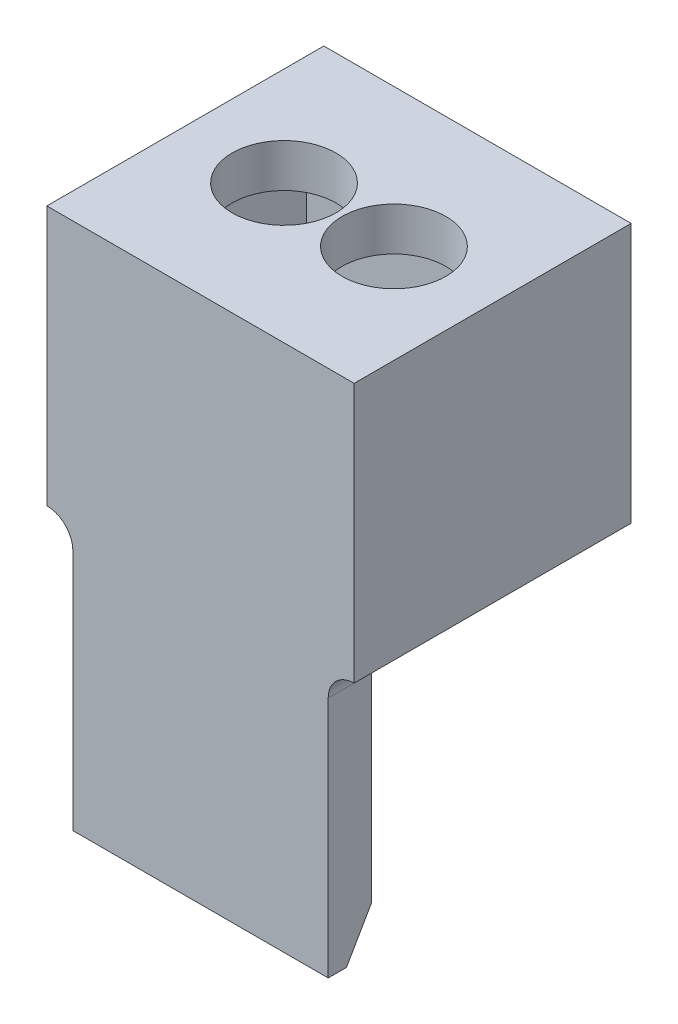
ISO-10303-21;
HEADER;
FILE_DESCRIPTION(('STEP AP214'),'2;1');
FILE_NAME('part.step','',(''),(''),'','','');
FILE_SCHEMA(('AUTOMOTIVE_DESIGN { 1 0 10303 214 1 1 1 1 }'));
ENDSEC;
DATA;
#1=APPLICATION_CONTEXT('core data for automotive mechanical design processes');
#2=APPLICATION_PROTOCOL_DEFINITION('international standard','automotive_design',2000,#1);
#3=PRODUCT_CONTEXT('',#1,'mechanical');
#4=PRODUCT('Part','Part','',(#3));
#5=PRODUCT_RELATED_PRODUCT_CATEGORY('part','',(#4));
#6=PRODUCT_DEFINITION_FORMATION('','',#4);
#7=PRODUCT_DEFINITION_CONTEXT('part definition',#1,'design');
#8=PRODUCT_DEFINITION('design','',#6,#7);
#9=PRODUCT_DEFINITION_SHAPE('','',#8);
#10=(LENGTH_UNIT() NAMED_UNIT(*) SI_UNIT(.MILLI.,.METRE.));
#11=(NAMED_UNIT(*) PLANE_ANGLE_UNIT() SI_UNIT($,.RADIAN.));
#12=(NAMED_UNIT(*) SI_UNIT($,.STERADIAN.) SOLID_ANGLE_UNIT());
#13=UNCERTAINTY_MEASURE_WITH_UNIT(LENGTH_MEASURE(1.E-05),#10,'distance_accuracy_value','');
#14=(GEOMETRIC_REPRESENTATION_CONTEXT(3) GLOBAL_UNCERTAINTY_ASSIGNED_CONTEXT((#13)) GLOBAL_UNIT_ASSIGNED_CONTEXT((#10,
#11,#12)) REPRESENTATION_CONTEXT('',''));
#15=CARTESIAN_POINT('',(0.,0.,0.));
#16=DIRECTION('',(0.,0.,1.));
#17=DIRECTION('',(1.,0.,0.));
#18=AXIS2_PLACEMENT_3D('',#15,#16,#17);
#19=CARTESIAN_POINT('',(11.3752118033071,0.,0.));
#20=DIRECTION('',(1.,0.,0.));
#21=DIRECTION('',(0.,0.,-1.));
#22=AXIS2_PLACEMENT_3D('',#19,#20,#21);
#23=PLANE('',#22);
#24=DIRECTION('',(0.,1.,0.));
#25=VECTOR('',#24,1.);
#26=CARTESIAN_POINT('',(11.3752118033071,13.0223465383006,0.659564597033571));
#27=LINE('',#26,#25);
#28=CARTESIAN_POINT('',(11.3752118033071,13.0223465383006,0.659564597033571));
#29=VERTEX_POINT('',#28);
#30=CARTESIAN_POINT('',(11.3752118033071,15.5223465383006,0.659564597033571));
#31=VERTEX_POINT('',#30);
#32=EDGE_CURVE('E151',#29,#31,#27,.T.);
#33=ORIENTED_EDGE('',*,*,#32,.F.);
#34=DIRECTION('',(0.,0.,-1.));
#35=VECTOR('',#34,1.);
#36=CARTESIAN_POINT('',(11.3752118033071,13.0223465383006,3.35956459703362));
#37=LINE('',#36,#35);
#38=CARTESIAN_POINT('',(11.3752118033071,13.0223465383006,2.85956459703362));
#39=VERTEX_POINT('',#38);
#40=EDGE_CURVE('E202',#39,#29,#37,.T.);
#41=ORIENTED_EDGE('',*,*,#40,.F.);
#42=DIRECTION('',(0.,1.,0.));
#43=VECTOR('',#42,1.);
#44=CARTESIAN_POINT('',(11.3752118033071,9.92234653830065,2.85956459703362));
#45=LINE('',#44,#43);
#46=CARTESIAN_POINT('',(11.3752118033071,15.5223465383006,2.85956459703362));
#47=VERTEX_POINT('',#46);
#48=EDGE_CURVE('E231',#39,#47,#45,.T.);
#49=ORIENTED_EDGE('',*,*,#48,.T.);
#50=DIRECTION('',(0.,0.,1.));
#51=VECTOR('',#50,1.);
#52=CARTESIAN_POINT('',(11.3752118033071,15.5223465383006,3.35956459703362));
#53=LINE('',#52,#51);
#54=EDGE_CURVE('E207',#31,#47,#53,.T.);
#55=ORIENTED_EDGE('',*,*,#54,.F.);
#56=EDGE_LOOP('',(#33,#41,#49,#55));
#57=FACE_BOUND('',#56,.T.);
#58=ADVANCED_FACE('F39',(#57),#23,.F.);
#59=CARTESIAN_POINT('',(11.3752118033071,9.92234653830065,3.35956459703362));
#60=DIRECTION('',(-1.,0.,0.));
#61=DIRECTION('',(0.,0.,1.));
#62=AXIS2_PLACEMENT_3D('',#59,#60,#61);
#63=PLANE('',#62);
#64=CARTESIAN_POINT('',(11.3752118033071,10.4223465383006,2.85956459703362));
#65=VERTEX_POINT('',#64);
#66=CARTESIAN_POINT('',(11.3752118033071,12.7223465383006,2.85956459703362));
#67=VERTEX_POINT('',#66);
#68=EDGE_CURVE('E232',#65,#67,#45,.T.);
#69=ORIENTED_EDGE('',*,*,#68,.T.);
#70=DIRECTION('',(0.,0.,-1.));
#71=VECTOR('',#70,1.);
#72=CARTESIAN_POINT('',(11.3752118033071,12.7223465383006,3.35956459703362));
#73=LINE('',#72,#71);
#74=CARTESIAN_POINT('',(11.3752118033071,12.7223465383006,3.35956459703362));
#75=VERTEX_POINT('',#74);
#76=EDGE_CURVE('E254',#67,#75,#73,.F.);
#77=ORIENTED_EDGE('',*,*,#76,.T.);
#78=DIRECTION('',(0.,1.,0.));
#79=VECTOR('',#78,1.);
#80=CARTESIAN_POINT('',(11.3752118033071,9.92234653830065,3.35956459703362));
#81=LINE('',#80,#79);
#82=CARTESIAN_POINT('',(11.3752118033071,9.92234653830065,3.35956459703362));
#83=VERTEX_POINT('',#82);
#84=EDGE_CURVE('E224',#83,#75,#81,.T.);
#85=ORIENTED_EDGE('',*,*,#84,.F.);
#86=DIRECTION('',(0.,0.,-1.));
#87=VECTOR('',#86,1.);
#88=CARTESIAN_POINT('',(11.3752118033071,9.92234653830065,3.35956459703362));
#89=LINE('',#88,#87);
#90=CARTESIAN_POINT('',(11.3752118033071,9.92234653830065,3.14823973162844));
#91=VERTEX_POINT('',#90);
#92=EDGE_CURVE('E227',#83,#91,#89,.T.);
#93=ORIENTED_EDGE('',*,*,#92,.T.);
#94=DIRECTION('',(0.,0.86602540378444,-0.499999999999999));
#95=VECTOR('',#94,1.);
#96=CARTESIAN_POINT('',(11.3752118033071,9.92234653830065,3.14823973162844));
#97=LINE('',#96,#95);
#98=EDGE_CURVE('E244',#91,#65,#97,.T.);
#99=ORIENTED_EDGE('',*,*,#98,.T.);
#100=EDGE_LOOP('',(#69,#77,#85,#93,#99));
#101=FACE_BOUND('',#100,.T.);
#102=ADVANCED_FACE('F281',(#101),#63,.F.);
#103=CARTESIAN_POINT('',(8.42521180330711,9.92234653830065,3.35956459703362));
#104=DIRECTION('',(1.,0.,0.));
#105=DIRECTION('',(0.,0.,-1.));
#106=AXIS2_PLACEMENT_3D('',#103,#104,#105);
#107=PLANE('',#106);
#108=DIRECTION('',(0.,-1.,0.));
#109=VECTOR('',#108,1.);
#110=CARTESIAN_POINT('',(8.42521180330711,9.92234653830065,3.35956459703362));
#111=LINE('',#110,#109);
#112=CARTESIAN_POINT('',(8.42521180330711,12.7223465383006,3.35956459703362));
#113=VERTEX_POINT('',#112);
#114=CARTESIAN_POINT('',(8.42521180330711,9.92234653830065,3.35956459703362));
#115=VERTEX_POINT('',#114);
#116=EDGE_CURVE('E219',#113,#115,#111,.T.);
#117=ORIENTED_EDGE('',*,*,#116,.F.);
#118=DIRECTION('',(0.,0.,-1.));
#119=VECTOR('',#118,1.);
#120=CARTESIAN_POINT('',(8.42521180330711,12.7223465383006,2.85956459703362));
#121=LINE('',#120,#119);
#122=CARTESIAN_POINT('',(8.42521180330711,12.7223465383006,2.85956459703362));
#123=VERTEX_POINT('',#122);
#124=EDGE_CURVE('E256',#113,#123,#121,.T.);
#125=ORIENTED_EDGE('',*,*,#124,.T.);
#126=DIRECTION('',(0.,-1.,0.));
#127=VECTOR('',#126,1.);
#128=CARTESIAN_POINT('',(8.42521180330711,9.92234653830065,2.85956459703362));
#129=LINE('',#128,#127);
#130=CARTESIAN_POINT('',(8.42521180330711,10.4223465383006,2.85956459703362));
#131=VERTEX_POINT('',#130);
#132=EDGE_CURVE('E218',#123,#131,#129,.T.);
#133=ORIENTED_EDGE('',*,*,#132,.T.);
#134=DIRECTION('',(0.,-0.86602540378444,0.499999999999999));
#135=VECTOR('',#134,1.);
#136=CARTESIAN_POINT('',(8.42521180330711,9.92234653830065,3.14823973162844));
#137=LINE('',#136,#135);
#138=CARTESIAN_POINT('',(8.42521180330711,9.92234653830065,3.14823973162844));
#139=VERTEX_POINT('',#138);
#140=EDGE_CURVE('E249',#131,#139,#137,.T.);
#141=ORIENTED_EDGE('',*,*,#140,.T.);
#142=DIRECTION('',(0.,0.,-1.));
#143=VECTOR('',#142,1.);
#144=CARTESIAN_POINT('',(8.42521180330711,9.92234653830065,3.35956459703362));
#145=LINE('',#144,#143);
#146=EDGE_CURVE('E238',#115,#139,#145,.T.);
#147=ORIENTED_EDGE('',*,*,#146,.F.);
#148=EDGE_LOOP('',(#117,#125,#133,#141,#147));
#149=FACE_BOUND('',#148,.T.);
#150=ADVANCED_FACE('F271',(#149),#107,.F.);
#151=CARTESIAN_POINT('',(8.42521180330711,9.92234653830065,3.35956459703362));
#152=DIRECTION('',(0.,1.,0.));
#153=DIRECTION('',(0.,0.,1.));
#154=AXIS2_PLACEMENT_3D('',#151,#152,#153);
#155=PLANE('',#154);
#156=ORIENTED_EDGE('',*,*,#146,.T.);
#157=DIRECTION('',(1.,0.,0.));
#158=VECTOR('',#157,1.);
#159=CARTESIAN_POINT('',(11.3752118033071,9.92234653830065,3.14823973162844));
#160=LINE('',#159,#158);
#161=EDGE_CURVE('E241',#139,#91,#160,.T.);
#162=ORIENTED_EDGE('',*,*,#161,.T.);
#163=ORIENTED_EDGE('',*,*,#92,.F.);
#164=DIRECTION('',(1.,0.,0.));
#165=VECTOR('',#164,1.);
#166=CARTESIAN_POINT('',(8.42521180330711,9.92234653830065,3.35956459703362));
#167=LINE('',#166,#165);
#168=EDGE_CURVE('E221',#115,#83,#167,.T.);
#169=ORIENTED_EDGE('',*,*,#168,.F.);
#170=EDGE_LOOP('',(#156,#162,#163,#169));
#171=FACE_BOUND('',#170,.T.);
#172=ADVANCED_FACE('F277',(#171),#155,.F.);
#173=CARTESIAN_POINT('',(0.,0.,3.35956459703362));
#174=DIRECTION('',(0.,0.,-1.));
#175=DIRECTION('',(-1.,0.,0.));
#176=AXIS2_PLACEMENT_3D('',#173,#174,#175);
#177=PLANE('',#176);
#178=DIRECTION('',(1.,0.,0.));
#179=VECTOR('',#178,1.);
#180=CARTESIAN_POINT('',(9.90021180330711,16.0223465383006,3.35956459703362));
#181=LINE('',#180,#179);
#182=CARTESIAN_POINT('',(8.1252118033071,16.0223465383006,3.35956459703362));
#183=VERTEX_POINT('',#182);
#184=CARTESIAN_POINT('',(11.6752118033071,16.0223465383006,3.35956459703362));
#185=VERTEX_POINT('',#184);
#186=EDGE_CURVE('E191',#183,#185,#181,.T.);
#187=ORIENTED_EDGE('',*,*,#186,.F.);
#188=DIRECTION('',(0.,-1.,0.));
#189=VECTOR('',#188,1.);
#190=CARTESIAN_POINT('',(8.1252118033071,15.5223465383006,3.35956459703362));
#191=LINE('',#190,#189);
#192=CARTESIAN_POINT('',(8.1252118033071,13.0223465383006,3.35956459703362));
#193=VERTEX_POINT('',#192);
#194=EDGE_CURVE('E162',#183,#193,#191,.T.);
#195=ORIENTED_EDGE('',*,*,#194,.T.);
#196=CARTESIAN_POINT('',(8.12521180330711,12.7223465383006,3.35956459703362));
#197=DIRECTION('',(0.,0.,-1.));
#198=DIRECTION('',(-1.,0.,0.));
#199=AXIS2_PLACEMENT_3D('',#196,#197,#198);
#200=CIRCLE('',#199,0.3);
#201=EDGE_CURVE('E11',#193,#113,#200,.T.);
#202=ORIENTED_EDGE('',*,*,#201,.T.);
#203=ORIENTED_EDGE('',*,*,#116,.T.);
#204=ORIENTED_EDGE('',*,*,#168,.T.);
#205=ORIENTED_EDGE('',*,*,#84,.T.);
#206=CARTESIAN_POINT('',(11.6752118033071,12.7223465383006,3.35956459703362));
#207=DIRECTION('',(0.,0.,-1.));
#208=DIRECTION('',(-1.,0.,0.));
#209=AXIS2_PLACEMENT_3D('',#206,#207,#208);
#210=CIRCLE('',#209,0.3);
#211=CARTESIAN_POINT('',(11.6752118033071,13.0223465383006,3.35956459703362));
#212=VERTEX_POINT('',#211);
#213=EDGE_CURVE('E261',#75,#212,#210,.T.);
#214=ORIENTED_EDGE('',*,*,#213,.T.);
#215=DIRECTION('',(0.,-1.,0.));
#216=VECTOR('',#215,1.);
#217=CARTESIAN_POINT('',(11.6752118033071,15.5223465383006,3.35956459703362));
#218=LINE('',#217,#216);
#219=EDGE_CURVE('E203',#185,#212,#218,.T.);
#220=ORIENTED_EDGE('',*,*,#219,.F.);
#221=EDGE_LOOP('',(#187,#195,#202,#203,#204,#205,#214,#220));
#222=FACE_BOUND('',#221,.T.);
#223=ADVANCED_FACE('F274',(#222),#177,.F.);
#224=CARTESIAN_POINT('',(0.,0.,2.85956459703362));
#225=DIRECTION('',(0.,0.,-1.));
#226=DIRECTION('',(-1.,0.,0.));
#227=AXIS2_PLACEMENT_3D('',#224,#225,#226);
#228=PLANE('',#227);
#229=ORIENTED_EDGE('',*,*,#68,.F.);
#230=DIRECTION('',(-1.,0.,0.));
#231=VECTOR('',#230,1.);
#232=CARTESIAN_POINT('',(8.42521180330711,10.4223465383006,2.85956459703362));
#233=LINE('',#232,#231);
#234=EDGE_CURVE('E246',#65,#131,#233,.T.);
#235=ORIENTED_EDGE('',*,*,#234,.T.);
#236=ORIENTED_EDGE('',*,*,#132,.F.);
#237=CARTESIAN_POINT('',(8.12521180330711,12.7223465383006,2.85956459703362));
#238=DIRECTION('',(0.,0.,-1.));
#239=DIRECTION('',(-1.,0.,0.));
#240=AXIS2_PLACEMENT_3D('',#237,#238,#239);
#241=CIRCLE('',#240,0.3);
#242=CARTESIAN_POINT('',(8.1252118033071,13.0223465383006,2.85956459703362));
#243=VERTEX_POINT('',#242);
#244=EDGE_CURVE('E47',#123,#243,#241,.F.);
#245=ORIENTED_EDGE('',*,*,#244,.T.);
#246=DIRECTION('',(-1.,0.,0.));
#247=VECTOR('',#246,1.);
#248=CARTESIAN_POINT('',(11.6752118033071,13.0223465383006,2.85956459703362));
#249=LINE('',#248,#247);
#250=CARTESIAN_POINT('',(8.42521180330711,13.0223465383006,2.85956459703362));
#251=VERTEX_POINT('',#250);
#252=EDGE_CURVE('E54',#251,#243,#249,.T.);
#253=ORIENTED_EDGE('',*,*,#252,.F.);
#254=CARTESIAN_POINT('',(8.42521180330711,15.5223465383006,2.85956459703362));
#255=VERTEX_POINT('',#254);
#256=EDGE_CURVE('E228',#255,#251,#129,.T.);
#257=ORIENTED_EDGE('',*,*,#256,.F.);
#258=DIRECTION('',(-1.,0.,0.));
#259=VECTOR('',#258,1.);
#260=CARTESIAN_POINT('',(8.42521180330711,15.5223465383006,2.85956459703362));
#261=LINE('',#260,#259);
#262=EDGE_CURVE('E222',#47,#255,#261,.T.);
#263=ORIENTED_EDGE('',*,*,#262,.F.);
#264=ORIENTED_EDGE('',*,*,#48,.F.);
#265=DIRECTION('',(-1.,0.,0.));
#266=VECTOR('',#265,1.);
#267=CARTESIAN_POINT('',(11.6752118033071,13.0223465383006,2.85956459703362));
#268=LINE('',#267,#266);
#269=CARTESIAN_POINT('',(11.6752118033071,13.0223465383006,2.85956459703362));
#270=VERTEX_POINT('',#269);
#271=EDGE_CURVE('E252',#270,#39,#268,.T.);
#272=ORIENTED_EDGE('',*,*,#271,.F.);
#273=CARTESIAN_POINT('',(11.6752118033071,12.7223465383006,2.85956459703362));
#274=DIRECTION('',(0.,0.,-1.));
#275=DIRECTION('',(-1.,0.,0.));
#276=AXIS2_PLACEMENT_3D('',#273,#274,#275);
#277=CIRCLE('',#276,0.3);
#278=EDGE_CURVE('E259',#270,#67,#277,.F.);
#279=ORIENTED_EDGE('',*,*,#278,.T.);
#280=EDGE_LOOP('',(#229,#235,#236,#245,#253,#257,#263,#264,#272,#279));
#281=FACE_BOUND('',#280,.T.);
#282=ADVANCED_FACE('F264',(#281),#228,.T.);
#283=CARTESIAN_POINT('',(11.6752118033071,13.0223465383006,3.35956459703362));
#284=DIRECTION('',(0.,1.,0.));
#285=DIRECTION('',(0.,0.,1.));
#286=AXIS2_PLACEMENT_3D('',#283,#284,#285);
#287=PLANE('',#286);
#288=DIRECTION('',(0.,0.,-1.));
#289=VECTOR('',#288,1.);
#290=CARTESIAN_POINT('',(11.6752118033071,13.0223465383006,3.35956459703362));
#291=LINE('',#290,#289);
#292=CARTESIAN_POINT('',(11.6752118033071,13.0223465383006,0.159564597033564));
#293=VERTEX_POINT('',#292);
#294=EDGE_CURVE('E206',#270,#293,#291,.T.);
#295=ORIENTED_EDGE('',*,*,#294,.F.);
#296=ORIENTED_EDGE('',*,*,#271,.T.);
#297=ORIENTED_EDGE('',*,*,#40,.T.);
#298=DIRECTION('',(1.,0.,0.));
#299=VECTOR('',#298,1.);
#300=CARTESIAN_POINT('',(9.90021180330711,13.0223465383006,0.659564597033571));
#301=LINE('',#300,#299);
#302=CARTESIAN_POINT('',(8.42521180330711,13.0223465383006,0.659564597033572));
#303=VERTEX_POINT('',#302);
#304=EDGE_CURVE('E200',#303,#29,#301,.T.);
#305=ORIENTED_EDGE('',*,*,#304,.F.);
#306=DIRECTION('',(0.,0.,-1.));
#307=VECTOR('',#306,1.);
#308=CARTESIAN_POINT('',(8.42521180330711,13.0223465383006,3.35956459703362));
#309=LINE('',#308,#307);
#310=EDGE_CURVE('E178',#251,#303,#309,.T.);
#311=ORIENTED_EDGE('',*,*,#310,.F.);
#312=ORIENTED_EDGE('',*,*,#252,.T.);
#313=DIRECTION('',(0.,0.,-1.));
#314=VECTOR('',#313,1.);
#315=CARTESIAN_POINT('',(8.1252118033071,13.0223465383006,3.35956459703362));
#316=LINE('',#315,#314);
#317=CARTESIAN_POINT('',(8.1252118033071,13.0223465383006,0.159564597033564));
#318=VERTEX_POINT('',#317);
#319=EDGE_CURVE('E161',#243,#318,#316,.T.);
#320=ORIENTED_EDGE('',*,*,#319,.T.);
#321=DIRECTION('',(-1.,0.,0.));
#322=VECTOR('',#321,1.);
#323=CARTESIAN_POINT('',(11.6752118033071,13.0223465383006,0.159564597033564));
#324=LINE('',#323,#322);
#325=EDGE_CURVE('E158',#293,#318,#324,.T.);
#326=ORIENTED_EDGE('',*,*,#325,.F.);
#327=EDGE_LOOP('',(#295,#296,#297,#305,#311,#312,#320,#326));
#328=FACE_BOUND('',#327,.T.);
#329=ADVANCED_FACE('F269',(#328),#287,.F.);
#330=CARTESIAN_POINT('',(11.6752118033071,15.5223465383006,0.159564597033565));
#331=DIRECTION('',(0.,0.,1.));
#332=DIRECTION('',(0.,-1.,0.));
#333=AXIS2_PLACEMENT_3D('',#330,#331,#332);
#334=PLANE('',#333);
#335=ORIENTED_EDGE('',*,*,#325,.T.);
#336=DIRECTION('',(0.,1.,0.));
#337=VECTOR('',#336,1.);
#338=CARTESIAN_POINT('',(8.1252118033071,15.5223465383006,0.159564597033565));
#339=LINE('',#338,#337);
#340=CARTESIAN_POINT('',(8.1252118033071,16.0223465383006,0.159564597033565));
#341=VERTEX_POINT('',#340);
#342=EDGE_CURVE('E155',#318,#341,#339,.T.);
#343=ORIENTED_EDGE('',*,*,#342,.T.);
#344=DIRECTION('',(-1.,0.,0.));
#345=VECTOR('',#344,1.);
#346=CARTESIAN_POINT('',(9.90021180330711,16.0223465383006,0.159564597033565));
#347=LINE('',#346,#345);
#348=CARTESIAN_POINT('',(11.6752118033071,16.0223465383006,0.159564597033565));
#349=VERTEX_POINT('',#348);
#350=EDGE_CURVE('E140',#349,#341,#347,.T.);
#351=ORIENTED_EDGE('',*,*,#350,.F.);
#352=DIRECTION('',(0.,1.,0.));
#353=VECTOR('',#352,1.);
#354=CARTESIAN_POINT('',(11.6752118033071,15.5223465383006,0.159564597033565));
#355=LINE('',#354,#353);
#356=EDGE_CURVE('E211',#293,#349,#355,.T.);
#357=ORIENTED_EDGE('',*,*,#356,.F.);
#358=EDGE_LOOP('',(#335,#343,#351,#357));
#359=FACE_BOUND('',#358,.T.);
#360=ADVANCED_FACE('F156',(#359),#334,.F.);
#361=CARTESIAN_POINT('',(11.6752118033071,0.,0.));
#362=DIRECTION('',(1.,0.,0.));
#363=DIRECTION('',(0.,0.,-1.));
#364=AXIS2_PLACEMENT_3D('',#361,#362,#363);
#365=PLANE('',#364);
#366=ORIENTED_EDGE('',*,*,#219,.T.);
#367=EDGE_CURVE('E208',#212,#270,#291,.T.);
#368=ORIENTED_EDGE('',*,*,#367,.T.);
#369=ORIENTED_EDGE('',*,*,#294,.T.);
#370=ORIENTED_EDGE('',*,*,#356,.T.);
#371=DIRECTION('',(0.,0.,-1.));
#372=VECTOR('',#371,1.);
#373=CARTESIAN_POINT('',(11.6752118033071,16.0223465383006,0.159564597033565));
#374=LINE('',#373,#372);
#375=EDGE_CURVE('E148',#185,#349,#374,.T.);
#376=ORIENTED_EDGE('',*,*,#375,.F.);
#377=EDGE_LOOP('',(#366,#368,#369,#370,#376));
#378=FACE_BOUND('',#377,.T.);
#379=ADVANCED_FACE('F289',(#378),#365,.T.);
#380=CARTESIAN_POINT('',(9.90021180330711,13.0223465383006,0.659564597033571));
#381=DIRECTION('',(0.,0.,-1.));
#382=DIRECTION('',(-1.,0.,0.));
#383=AXIS2_PLACEMENT_3D('',#380,#381,#382);
#384=PLANE('',#383);
#385=ORIENTED_EDGE('',*,*,#32,.T.);
#386=DIRECTION('',(1.,0.,0.));
#387=VECTOR('',#386,1.);
#388=CARTESIAN_POINT('',(9.90021180330711,15.5223465383006,0.659564597033571));
#389=LINE('',#388,#387);
#390=CARTESIAN_POINT('',(8.42521180330711,15.5223465383006,0.659564597033571));
#391=VERTEX_POINT('',#390);
#392=EDGE_CURVE('E197',#391,#31,#389,.T.);
#393=ORIENTED_EDGE('',*,*,#392,.F.);
#394=DIRECTION('',(0.,1.,0.));
#395=VECTOR('',#394,1.);
#396=CARTESIAN_POINT('',(8.42521180330711,13.0223465383006,0.659564597033571));
#397=LINE('',#396,#395);
#398=EDGE_CURVE('E167',#303,#391,#397,.T.);
#399=ORIENTED_EDGE('',*,*,#398,.F.);
#400=ORIENTED_EDGE('',*,*,#304,.T.);
#401=EDGE_LOOP('',(#385,#393,#399,#400));
#402=FACE_BOUND('',#401,.T.);
#403=ADVANCED_FACE('F297',(#402),#384,.F.);
#404=CARTESIAN_POINT('',(0.,15.5223465383006,0.));
#405=DIRECTION('',(0.,1.,0.));
#406=DIRECTION('',(0.,0.,1.));
#407=AXIS2_PLACEMENT_3D('',#404,#405,#406);
#408=PLANE('',#407);
#409=CARTESIAN_POINT('',(10.5352118033071,15.5223465383006,1.7595645970336));
#410=DIRECTION('',(0.,1.,0.));
#411=DIRECTION('',(0.,0.,1.));
#412=AXIS2_PLACEMENT_3D('',#409,#410,#411);
#413=CIRCLE('',#412,0.6);
#414=CARTESIAN_POINT('',(10.5352118033071,15.5223465383006,2.3595645970336));
#415=VERTEX_POINT('',#414);
#416=EDGE_CURVE('E183',#415,#415,#413,.T.);
#417=ORIENTED_EDGE('',*,*,#416,.T.);
#418=EDGE_LOOP('',(#417));
#419=FACE_BOUND('',#418,.T.);
#420=ORIENTED_EDGE('',*,*,#54,.T.);
#421=ORIENTED_EDGE('',*,*,#262,.T.);
#422=DIRECTION('',(0.,0.,1.));
#423=VECTOR('',#422,1.);
#424=CARTESIAN_POINT('',(8.42521180330711,15.5223465383006,3.35956459703362));
#425=LINE('',#424,#423);
#426=EDGE_CURVE('E171',#391,#255,#425,.T.);
#427=ORIENTED_EDGE('',*,*,#426,.F.);
#428=ORIENTED_EDGE('',*,*,#392,.T.);
#429=EDGE_LOOP('',(#420,#421,#427,#428));
#430=FACE_BOUND('',#429,.T.);
#431=CARTESIAN_POINT('',(9.26521180330711,15.5223465383006,1.7595645970336));
#432=DIRECTION('',(0.,-1.,0.));
#433=DIRECTION('',(0.,0.,1.));
#434=AXIS2_PLACEMENT_3D('',#431,#432,#433);
#435=CIRCLE('',#434,0.6);
#436=CARTESIAN_POINT('',(9.26521180330711,15.5223465383006,2.3595645970336));
#437=VERTEX_POINT('',#436);
#438=EDGE_CURVE('E174',#437,#437,#435,.T.);
#439=ORIENTED_EDGE('',*,*,#438,.F.);
#440=EDGE_LOOP('',(#439));
#441=FACE_BOUND('',#440,.T.);
#442=ADVANCED_FACE('F303',(#419,#430,#441),#408,.F.);
#443=CARTESIAN_POINT('',(0.,16.0223465383006,0.));
#444=DIRECTION('',(0.,1.,0.));
#445=DIRECTION('',(0.,0.,1.));
#446=AXIS2_PLACEMENT_3D('',#443,#444,#445);
#447=PLANE('',#446);
#448=ORIENTED_EDGE('',*,*,#350,.T.);
#449=DIRECTION('',(0.,0.,-1.));
#450=VECTOR('',#449,1.);
#451=CARTESIAN_POINT('',(8.1252118033071,16.0223465383006,0.159564597033565));
#452=LINE('',#451,#450);
#453=EDGE_CURVE('E146',#183,#341,#452,.T.);
#454=ORIENTED_EDGE('',*,*,#453,.F.);
#455=ORIENTED_EDGE('',*,*,#186,.T.);
#456=ORIENTED_EDGE('',*,*,#375,.T.);
#457=EDGE_LOOP('',(#448,#454,#455,#456));
#458=FACE_BOUND('',#457,.T.);
#459=CARTESIAN_POINT('',(10.5352118033071,16.0223465383006,1.7595645970336));
#460=DIRECTION('',(0.,1.,0.));
#461=DIRECTION('',(0.,0.,1.));
#462=AXIS2_PLACEMENT_3D('',#459,#460,#461);
#463=CIRCLE('',#462,0.6);
#464=CARTESIAN_POINT('',(10.5352118033071,16.0223465383006,2.3595645970336));
#465=VERTEX_POINT('',#464);
#466=EDGE_CURVE('E188',#465,#465,#463,.T.);
#467=ORIENTED_EDGE('',*,*,#466,.F.);
#468=EDGE_LOOP('',(#467));
#469=FACE_BOUND('',#468,.T.);
#470=CARTESIAN_POINT('',(9.26521180330711,16.0223465383006,1.7595645970336));
#471=DIRECTION('',(0.,-1.,0.));
#472=DIRECTION('',(0.,0.,1.));
#473=AXIS2_PLACEMENT_3D('',#470,#471,#472);
#474=CIRCLE('',#473,0.6);
#475=CARTESIAN_POINT('',(9.26521180330711,16.0223465383006,2.3595645970336));
#476=VERTEX_POINT('',#475);
#477=EDGE_CURVE('E168',#476,#476,#474,.T.);
#478=ORIENTED_EDGE('',*,*,#477,.T.);
#479=EDGE_LOOP('',(#478));
#480=FACE_BOUND('',#479,.T.);
#481=ADVANCED_FACE('F142',(#458,#469,#480),#447,.T.);
#482=CARTESIAN_POINT('',(10.5352118033071,16.0223465383006,1.7595645970336));
#483=DIRECTION('',(0.,-1.,0.));
#484=DIRECTION('',(0.,0.,-1.));
#485=AXIS2_PLACEMENT_3D('',#482,#483,#484);
#486=CYLINDRICAL_SURFACE('',#485,0.6);
#487=ORIENTED_EDGE('',*,*,#466,.T.);
#488=EDGE_LOOP('',(#487));
#489=FACE_BOUND('',#488,.T.);
#490=ORIENTED_EDGE('',*,*,#416,.F.);
#491=EDGE_LOOP('',(#490));
#492=FACE_BOUND('',#491,.T.);
#493=ADVANCED_FACE('F446',(#489,#492),#486,.F.);
#494=CARTESIAN_POINT('',(8.42521180330711,0.,0.));
#495=DIRECTION('',(-1.,0.,0.));
#496=DIRECTION('',(0.,0.,-1.));
#497=AXIS2_PLACEMENT_3D('',#494,#495,#496);
#498=PLANE('',#497);
#499=ORIENTED_EDGE('',*,*,#310,.T.);
#500=ORIENTED_EDGE('',*,*,#398,.T.);
#501=ORIENTED_EDGE('',*,*,#426,.T.);
#502=ORIENTED_EDGE('',*,*,#256,.T.);
#503=EDGE_LOOP('',(#499,#500,#501,#502));
#504=FACE_BOUND('',#503,.T.);
#505=ADVANCED_FACE('F301',(#504),#498,.F.);
#506=CARTESIAN_POINT('',(8.1252118033071,0.,0.));
#507=DIRECTION('',(-1.,0.,0.));
#508=DIRECTION('',(0.,0.,-1.));
#509=AXIS2_PLACEMENT_3D('',#506,#507,#508);
#510=PLANE('',#509);
#511=ORIENTED_EDGE('',*,*,#194,.F.);
#512=ORIENTED_EDGE('',*,*,#453,.T.);
#513=ORIENTED_EDGE('',*,*,#342,.F.);
#514=ORIENTED_EDGE('',*,*,#319,.F.);
#515=EDGE_CURVE('E180',#193,#243,#316,.T.);
#516=ORIENTED_EDGE('',*,*,#515,.F.);
#517=EDGE_LOOP('',(#511,#512,#513,#514,#516));
#518=FACE_BOUND('',#517,.T.);
#519=ADVANCED_FACE('F165',(#518),#510,.T.);
#520=CARTESIAN_POINT('',(9.26521180330711,16.0223465383006,1.7595645970336));
#521=DIRECTION('',(0.,-1.,0.));
#522=DIRECTION('',(0.,0.,-1.));
#523=AXIS2_PLACEMENT_3D('',#520,#521,#522);
#524=CYLINDRICAL_SURFACE('',#523,0.6);
#525=ORIENTED_EDGE('',*,*,#477,.F.);
#526=EDGE_LOOP('',(#525));
#527=FACE_BOUND('',#526,.T.);
#528=ORIENTED_EDGE('',*,*,#438,.T.);
#529=EDGE_LOOP('',(#528));
#530=FACE_BOUND('',#529,.T.);
#531=ADVANCED_FACE('F311',(#527,#530),#524,.F.);
#532=CARTESIAN_POINT('',(8.42521180330711,9.92234653830065,3.14823973162844));
#533=DIRECTION('',(0.,-0.499999999999999,-0.86602540378444));
#534=DIRECTION('',(-1.,0.,0.));
#535=AXIS2_PLACEMENT_3D('',#532,#533,#534);
#536=PLANE('',#535);
#537=ORIENTED_EDGE('',*,*,#140,.F.);
#538=ORIENTED_EDGE('',*,*,#234,.F.);
#539=ORIENTED_EDGE('',*,*,#98,.F.);
#540=ORIENTED_EDGE('',*,*,#161,.F.);
#541=EDGE_LOOP('',(#537,#538,#539,#540));
#542=FACE_BOUND('',#541,.T.);
#543=ADVANCED_FACE('F313',(#542),#536,.T.);
#544=CARTESIAN_POINT('',(11.6752118033071,12.7223465383006,3.35956459703362));
#545=DIRECTION('',(0.,0.,1.));
#546=DIRECTION('',(1.,0.,0.));
#547=AXIS2_PLACEMENT_3D('',#544,#545,#546);
#548=CYLINDRICAL_SURFACE('',#547,0.3);
#549=ORIENTED_EDGE('',*,*,#213,.F.);
#550=ORIENTED_EDGE('',*,*,#76,.F.);
#551=ORIENTED_EDGE('',*,*,#278,.F.);
#552=ORIENTED_EDGE('',*,*,#367,.F.);
#553=EDGE_LOOP('',(#549,#550,#551,#552));
#554=FACE_BOUND('',#553,.T.);
#555=ADVANCED_FACE('F286',(#554),#548,.F.);
#556=CARTESIAN_POINT('',(8.12521180330711,12.7223465383006,3.35956459703362));
#557=DIRECTION('',(0.,0.,1.));
#558=DIRECTION('',(1.,0.,0.));
#559=AXIS2_PLACEMENT_3D('',#556,#557,#558);
#560=CYLINDRICAL_SURFACE('',#559,0.3);
#561=ORIENTED_EDGE('',*,*,#201,.F.);
#562=ORIENTED_EDGE('',*,*,#515,.T.);
#563=ORIENTED_EDGE('',*,*,#244,.F.);
#564=ORIENTED_EDGE('',*,*,#124,.F.);
#565=EDGE_LOOP('',(#561,#562,#563,#564));
#566=FACE_BOUND('',#565,.T.);
#567=ADVANCED_FACE('F41',(#566),#560,.F.);
#568=CLOSED_SHELL('',(#58,#102,#150,#172,#223,#282,#329,#360,#379,#403,#442,#481,#493,#505,#519,
#531,#543,#555,#567));
#569=MANIFOLD_SOLID_BREP('B2',#568);
#570=ADVANCED_BREP_SHAPE_REPRESENTATION('',(#18,#569),#14);
#571=SHAPE_DEFINITION_REPRESENTATION(#9,#570);
ENDSEC;
END-ISO-10303-21;
